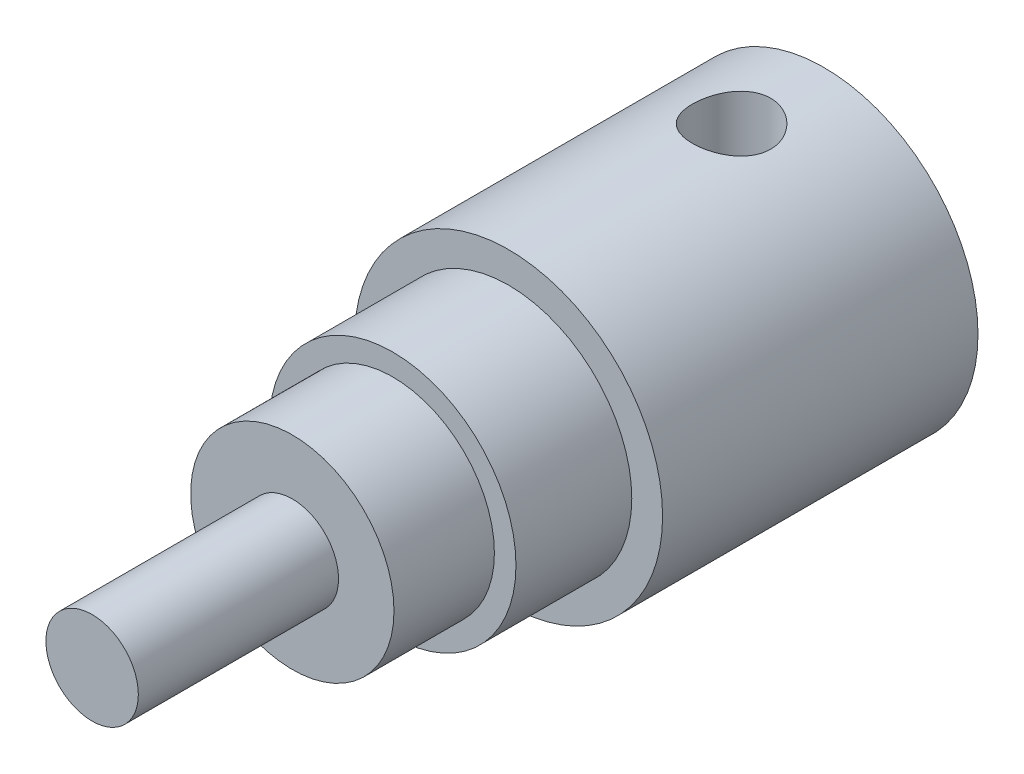
ISO-10303-21;
HEADER;
FILE_DESCRIPTION(('STEP AP214'),'2;1');
FILE_NAME('part.step','',(''),(''),'','','');
FILE_SCHEMA(('AUTOMOTIVE_DESIGN { 1 0 10303 214 1 1 1 1 }'));
ENDSEC;
DATA;
#1=APPLICATION_CONTEXT('core data for automotive mechanical design processes');
#2=APPLICATION_PROTOCOL_DEFINITION('international standard','automotive_design',2000,#1);
#3=PRODUCT_CONTEXT('',#1,'mechanical');
#4=PRODUCT('Part','Part','',(#3));
#5=PRODUCT_RELATED_PRODUCT_CATEGORY('part','',(#4));
#6=PRODUCT_DEFINITION_FORMATION('','',#4);
#7=PRODUCT_DEFINITION_CONTEXT('part definition',#1,'design');
#8=PRODUCT_DEFINITION('design','',#6,#7);
#9=PRODUCT_DEFINITION_SHAPE('','',#8);
#10=(LENGTH_UNIT() NAMED_UNIT(*) SI_UNIT(.MILLI.,.METRE.));
#11=(NAMED_UNIT(*) PLANE_ANGLE_UNIT() SI_UNIT($,.RADIAN.));
#12=(NAMED_UNIT(*) SI_UNIT($,.STERADIAN.) SOLID_ANGLE_UNIT());
#13=UNCERTAINTY_MEASURE_WITH_UNIT(LENGTH_MEASURE(1.E-05),#10,'distance_accuracy_value','');
#14=(GEOMETRIC_REPRESENTATION_CONTEXT(3) GLOBAL_UNCERTAINTY_ASSIGNED_CONTEXT((#13)) GLOBAL_UNIT_ASSIGNED_CONTEXT((#10,
#11,#12)) REPRESENTATION_CONTEXT('',''));
#15=CARTESIAN_POINT('',(0.,0.,0.));
#16=DIRECTION('',(0.,0.,1.));
#17=DIRECTION('',(1.,0.,0.));
#18=AXIS2_PLACEMENT_3D('',#15,#16,#17);
#19=CARTESIAN_POINT('',(0.,0.,86.7));
#20=DIRECTION('',(0.,0.,-1.));
#21=DIRECTION('',(-1.,0.,0.));
#22=AXIS2_PLACEMENT_3D('',#19,#20,#21);
#23=CYLINDRICAL_SURFACE('',#22,16.5);
#24=CARTESIAN_POINT('',(0.,0.,70.));
#25=DIRECTION('',(0.,0.,1.));
#26=DIRECTION('',(1.,0.,0.));
#27=AXIS2_PLACEMENT_3D('',#24,#25,#26);
#28=CIRCLE('',#27,16.5);
#29=CARTESIAN_POINT('',(16.5,0.,70.));
#30=VERTEX_POINT('',#29);
#31=EDGE_CURVE('E11',#30,#30,#28,.T.);
#32=ORIENTED_EDGE('',*,*,#31,.T.);
#33=EDGE_LOOP('',(#32));
#34=FACE_BOUND('',#33,.T.);
#35=CARTESIAN_POINT('',(0.,0.,86.3));
#36=DIRECTION('',(0.,0.,1.));
#37=DIRECTION('',(1.,0.,0.));
#38=AXIS2_PLACEMENT_3D('',#35,#36,#37);
#39=CIRCLE('',#38,16.5);
#40=CARTESIAN_POINT('',(16.5,0.,86.3));
#41=VERTEX_POINT('',#40);
#42=EDGE_CURVE('E46',#41,#41,#39,.T.);
#43=ORIENTED_EDGE('',*,*,#42,.F.);
#44=EDGE_LOOP('',(#43));
#45=FACE_BOUND('',#44,.T.);
#46=ADVANCED_FACE('F41',(#34,#45),#23,.T.);
#47=CARTESIAN_POINT('',(0.,0.,51.2));
#48=DIRECTION('',(0.,0.,-1.));
#49=DIRECTION('',(-1.,0.,0.));
#50=AXIS2_PLACEMENT_3D('',#47,#48,#49);
#51=CYLINDRICAL_SURFACE('',#50,25.);
#52=CARTESIAN_POINT('',(0.,-25.,21.35));
#53=CARTESIAN_POINT('',(0.175385131929487,-25.0000033140325,21.3500054099431));
#54=CARTESIAN_POINT('',(0.350711748212745,-24.998151704908,21.3427328728794));
#55=CARTESIAN_POINT('',(0.700135931108324,-24.9908042668233,21.3137168326743));
#56=CARTESIAN_POINT('',(0.874233361490483,-24.9853080401456,21.2919717502209));
#57=CARTESIAN_POINT('',(1.21993244028655,-24.9708174064133,21.2341796780531));
#58=CARTESIAN_POINT('',(1.39153334466094,-24.9618219777842,21.1981285116872));
#59=CARTESIAN_POINT('',(1.73104281582321,-24.9405779457084,21.1120103227938));
#60=CARTESIAN_POINT('',(1.89894999679082,-24.92832814308,21.0619381333887));
#61=CARTESIAN_POINT('',(2.22957313318312,-24.9009333086136,20.9482782193175));
#62=CARTESIAN_POINT('',(2.39229703984096,-24.8857929878945,20.884712468562));
#63=CARTESIAN_POINT('',(2.71180585607342,-24.8530060892262,20.7444806948715));
#64=CARTESIAN_POINT('',(2.86858854648412,-24.8353585862576,20.6678098347052));
#65=CARTESIAN_POINT('',(3.17507415772351,-24.7980388505881,20.5019771427345));
#66=CARTESIAN_POINT('',(3.32477957941938,-24.7783673410266,20.4128197680435));
#67=CARTESIAN_POINT('',(3.61627276678461,-24.7375068038783,20.2225830138152));
#68=CARTESIAN_POINT('',(3.75805752505357,-24.7163172067649,20.1214991506316));
#69=CARTESIAN_POINT('',(4.03532969402347,-24.6725795464707,19.9061190207149));
#70=CARTESIAN_POINT('',(4.17064997364941,-24.6500135000218,19.7916112009001));
#71=CARTESIAN_POINT('',(4.43126322722715,-24.604499890037,19.5516799371048));
#72=CARTESIAN_POINT('',(4.5565524618244,-24.5815521880429,19.4262524585486));
#73=CARTESIAN_POINT('',(4.79620123658546,-24.5359192277785,19.1653712680362));
#74=CARTESIAN_POINT('',(4.91056349701768,-24.5132339054314,19.0299200664626));
#75=CARTESIAN_POINT('',(5.12766970707211,-24.4687410868686,18.7497890634005));
#76=CARTESIAN_POINT('',(5.23040935139997,-24.4469339178558,18.6051058730001));
#77=CARTESIAN_POINT('',(5.42496619160096,-24.4045038749107,18.3052471607241));
#78=CARTESIAN_POINT('',(5.51659553987815,-24.3839037894737,18.1499464154619));
#79=CARTESIAN_POINT('',(5.68644683418524,-24.3448540601681,17.8318460897849));
#80=CARTESIAN_POINT('',(5.76466370521984,-24.3264052311302,17.6690437003389));
#81=CARTESIAN_POINT('',(5.9069972915349,-24.292236559421,17.3371853808661));
#82=CARTESIAN_POINT('',(5.97112106435674,-24.2765153516461,17.168132630674));
#83=CARTESIAN_POINT('',(6.08480496079491,-24.2482684978705,16.8249423418518));
#84=CARTESIAN_POINT('',(6.13435987562112,-24.2357439949951,16.6508030090238));
#85=CARTESIAN_POINT('',(6.25867119421337,-24.2040633255174,16.1299145562071));
#86=CARTESIAN_POINT('',(6.31219365671174,-24.1900229808473,15.7773869553189));
#87=CARTESIAN_POINT('',(6.34773296739198,-24.1806996532994,15.2460068033738));
#88=CARTESIAN_POINT('',(6.35211509987145,-24.1795498874752,15.0683800615206));
#89=CARTESIAN_POINT('',(6.34600958727861,-24.1811534720988,14.7133782625875));
#90=CARTESIAN_POINT('',(6.33552180276144,-24.1839068591489,14.5360032078833));
#91=CARTESIAN_POINT('',(6.28268809717186,-24.1977155031317,14.0152322936276));
#92=CARTESIAN_POINT('',(6.21956614571278,-24.2141664349554,13.6738553985158));
#93=CARTESIAN_POINT('',(6.03900283866144,-24.2598212948346,13.0068846713011));
#94=CARTESIAN_POINT('',(5.92155750230573,-24.2890261574767,12.6812919977823));
#95=CARTESIAN_POINT('',(5.6344406783203,-24.3572368702812,12.0509838529052));
#96=CARTESIAN_POINT('',(5.46423991264386,-24.3963412756549,11.7465200703768));
#97=CARTESIAN_POINT('',(5.07681252447857,-24.479892350873,11.1699628976026));
#98=CARTESIAN_POINT('',(4.8595774296198,-24.5243399825589,10.8978753530418));
#99=CARTESIAN_POINT('',(4.37666050491634,-24.6151752029657,10.385358502392));
#100=CARTESIAN_POINT('',(4.10973956733923,-24.661581359405,10.1460985302972));
#101=CARTESIAN_POINT('',(3.53898905594361,-24.7499248963044,9.71551153610942));
#102=CARTESIAN_POINT('',(3.23515828244191,-24.7918621314276,9.52418607265477));
#103=CARTESIAN_POINT('',(2.59758157702115,-24.8667639765151,9.19445107466391));
#104=CARTESIAN_POINT('',(2.2637308381859,-24.8996953901051,9.05623657417293));
#105=CARTESIAN_POINT('',(1.57629931595442,-24.9526282129545,8.83822054163615));
#106=CARTESIAN_POINT('',(1.22272244694252,-24.9726321776478,8.75840746467474));
#107=CARTESIAN_POINT('',(0.690770502675092,-24.9910699052583,8.68522034531726));
#108=CARTESIAN_POINT('',(0.515500629471045,-24.9953043832338,8.66850903652274));
#109=CARTESIAN_POINT('',(0.164143779856978,-25.0000762389562,8.64968969067066));
#110=CARTESIAN_POINT('',(-0.0119428655650596,-25.0006150022359,8.64757618085986));
#111=CARTESIAN_POINT('',(-0.363660306591557,-24.9979742005041,8.65797927589998));
#112=CARTESIAN_POINT('',(-0.539291052760423,-24.9947942478547,8.67049740594938));
#113=CARTESIAN_POINT('',(-0.888803892814272,-24.9848070393398,8.71005154312242));
#114=CARTESIAN_POINT('',(-1.06268603283897,-24.9779998794412,8.73708716614984));
#115=CARTESIAN_POINT('',(-1.40478706505814,-24.9610788400627,8.80492006918042));
#116=CARTESIAN_POINT('',(-1.57305193240279,-24.9510174872923,8.8454990542083));
#117=CARTESIAN_POINT('',(-1.90551391214506,-24.9278315337674,8.94018231292668));
#118=CARTESIAN_POINT('',(-2.06971103024151,-24.9147069373046,8.99428656766741));
#119=CARTESIAN_POINT('',(-2.39297866197959,-24.885738851179,9.11561668278025));
#120=CARTESIAN_POINT('',(-2.5520479204993,-24.8698947017767,9.18284572765596));
#121=CARTESIAN_POINT('',(-2.8639328165778,-24.8359113238401,9.32989382182563));
#122=CARTESIAN_POINT('',(-3.01675049492381,-24.8177728523133,9.40970872057288));
#123=CARTESIAN_POINT('',(-3.31799190742229,-24.7793142249094,9.58297331058306));
#124=CARTESIAN_POINT('',(-3.46628169429449,-24.7589598620779,9.67664830854903));
#125=CARTESIAN_POINT('',(-3.75443091494178,-24.716906066827,9.87580128872815));
#126=CARTESIAN_POINT('',(-3.89429316174534,-24.6952070881876,9.98127529859231));
#127=CARTESIAN_POINT('',(-4.16482780953606,-24.6510244720375,10.2034015188438));
#128=CARTESIAN_POINT('',(-4.29549549202925,-24.6285404403791,10.3200593970977));
#129=CARTESIAN_POINT('',(-4.54669182494445,-24.5834065181769,10.5637065419216));
#130=CARTESIAN_POINT('',(-4.66722397854383,-24.5607566879054,10.6906922087624));
#131=CARTESIAN_POINT('',(-4.90040324536703,-24.5153120079901,10.9576295394875));
#132=CARTESIAN_POINT('',(-5.01276648501162,-24.4925285086167,11.0978312941315));
#133=CARTESIAN_POINT('',(-5.22524789579797,-24.4480789818796,11.3873126498664));
#134=CARTESIAN_POINT('',(-5.32537052190115,-24.4264125496304,11.5365889185018));
#135=CARTESIAN_POINT('',(-5.51273292509099,-24.3848106858986,11.8433269675273));
#136=CARTESIAN_POINT('',(-5.5999679983822,-24.3648758875291,12.0007917083962));
#137=CARTESIAN_POINT('',(-5.76081936737025,-24.3273463910993,12.3227207829183));
#138=CARTESIAN_POINT('',(-5.83444114157494,-24.309750752477,12.4871822678957));
#139=CARTESIAN_POINT('',(-5.96715018090579,-24.2775155048581,12.8210757013109));
#140=CARTESIAN_POINT('',(-6.02631656454941,-24.2628598870434,12.9904746407226));
#141=CARTESIAN_POINT('',(-6.13013627779891,-24.2368375789666,13.3338411647936));
#142=CARTESIAN_POINT('',(-6.17479521125169,-24.2254696189552,13.5078069572651));
#143=CARTESIAN_POINT('',(-6.24924480760445,-24.2063714529045,13.8590903842994));
#144=CARTESIAN_POINT('',(-6.27903543982851,-24.1986412543705,14.0364080257769));
#145=CARTESIAN_POINT('',(-6.32348068118509,-24.1870651827754,14.3930546713557));
#146=CARTESIAN_POINT('',(-6.3381356689265,-24.1832192125527,14.5723836250317));
#147=CARTESIAN_POINT('',(-6.35196741532382,-24.17958967931,14.9263056479132));
#148=CARTESIAN_POINT('',(-6.35159362065699,-24.1796881544406,15.1008801009263));
#149=CARTESIAN_POINT('',(-6.33647814832019,-24.1836536944327,15.4494241678649));
#150=CARTESIAN_POINT('',(-6.32173151884021,-24.1875220581174,15.6233935525979));
#151=CARTESIAN_POINT('',(-6.27799859048092,-24.1989099365428,15.9693403160074));
#152=CARTESIAN_POINT('',(-6.24901790761044,-24.2064280112858,16.1413184529562));
#153=CARTESIAN_POINT('',(-6.17705027748429,-24.2248927374141,16.4821962628097));
#154=CARTESIAN_POINT('',(-6.13405811669454,-24.2358406649553,16.6510947650726));
#155=CARTESIAN_POINT('',(-6.03475741455481,-24.2607564191176,16.9834519637395));
#156=CARTESIAN_POINT('',(-5.9785405559036,-24.2747033994636,17.1469396466053));
#157=CARTESIAN_POINT('',(-5.85304980514577,-24.3052664392567,17.4686285234356));
#158=CARTESIAN_POINT('',(-5.78377145539905,-24.3218834096341,17.6268278908337));
#159=CARTESIAN_POINT('',(-5.63268434139098,-24.3573168421669,17.9368522797336));
#160=CARTESIAN_POINT('',(-5.55087642656447,-24.3761331551987,18.0886777324632));
#161=CARTESIAN_POINT('',(-5.37529693336304,-24.415451526107,18.3850179438036));
#162=CARTESIAN_POINT('',(-5.28152501592703,-24.4359536317531,18.5295324950606));
#163=CARTESIAN_POINT('',(-5.0799505600607,-24.4786641348243,18.8141617731391));
#164=CARTESIAN_POINT('',(-4.97183707362827,-24.5009036881897,18.9540516982394));
#165=CARTESIAN_POINT('',(-4.74441701318979,-24.5459556050014,19.2242370300207));
#166=CARTESIAN_POINT('',(-4.62511399688802,-24.5687677847036,19.3545354629514));
#167=CARTESIAN_POINT('',(-4.37599360895126,-24.6143600323575,19.6048206454826));
#168=CARTESIAN_POINT('',(-4.24617018504563,-24.6371400740438,19.7248013764459));
#169=CARTESIAN_POINT('',(-3.97695652834308,-24.6820264544071,19.9535345889522));
#170=CARTESIAN_POINT('',(-3.83756977795974,-24.7041330341302,20.0622911219546));
#171=CARTESIAN_POINT('',(-3.547306953288,-24.7474958900468,20.269872599814));
#172=CARTESIAN_POINT('',(-3.39626113955255,-24.7687275444089,20.3684655492735));
#173=CARTESIAN_POINT('',(-3.08619692050165,-24.8092689611298,20.5525113988661));
#174=CARTESIAN_POINT('',(-2.92718147342273,-24.8285794287816,20.6379691274376));
#175=CARTESIAN_POINT('',(-2.60227981802529,-24.864730563437,20.7950994826663));
#176=CARTESIAN_POINT('',(-2.43639649502683,-24.8815722543835,20.8667778282846));
#177=CARTESIAN_POINT('',(-2.09893912814839,-24.9123102089582,20.9957990746599));
#178=CARTESIAN_POINT('',(-1.92736592500747,-24.9262069055172,21.0531440827209));
#179=CARTESIAN_POINT('',(-1.46941499709399,-24.9583988941249,21.1847047232181));
#180=CARTESIAN_POINT('',(-1.1791896569923,-24.9739004364578,21.2465805264305));
#181=CARTESIAN_POINT('',(-0.592586910015832,-24.994697780879,21.3292219449746));
#182=CARTESIAN_POINT('',(-0.296209999329344,-24.9999944028919,21.3499908630839));
#183=CARTESIAN_POINT('',(0.,-25.,21.35));
#184=B_SPLINE_CURVE_WITH_KNOTS('',3,(#52,#53,#54,#55,#56,#57,#58,#59,#60,#61,#62,#63,#64,#65,
#66,#67,#68,#69,#70,#71,#72,#73,#74,#75,#76,#77,#78,#79,#80,#81,#82,#83,#84,#85,#86,#87,#88,#89,
#90,#91,#92,#93,#94,#95,#96,#97,#98,#99,#100,#101,#102,#103,#104,#105,#106,#107,#108,#109,#110,
#111,#112,#113,#114,#115,#116,#117,#118,#119,#120,#121,#122,#123,#124,#125,#126,#127,#128,#129,
#130,#131,#132,#133,#134,#135,#136,#137,#138,#139,#140,#141,#142,#143,#144,#145,#146,#147,#148,
#149,#150,#151,#152,#153,#154,#155,#156,#157,#158,#159,#160,#161,#162,#163,#164,#165,#166,#167,
#168,#169,#170,#171,#172,#173,#174,#175,#176,#177,#178,#179,#180,#181,#182,#183),.UNSPECIFIED.,
.T.,.F.,(4,2,2,2,2,2,2,2,2,2,2,2,2,2,2,2,2,2,2,2,2,2,2,2,2,2,2,2,2,2,2,2,2,2,2,2,2,2,2,2,2,2,2,
2,2,2,2,2,2,2,2,2,2,2,2,2,2,2,2,2,2,2,2,2,2,4),(0.,0.525894291514284,1.05184598048871,
1.57795133380533,2.10425081756704,2.62969972268931,3.15534299691436,3.68079911654444,
4.2064534094648,4.74192791781956,5.27760111886222,5.81314061477869,6.34887784219313,
6.89268532850275,7.43669812809239,7.98043787305707,8.52437178502414,9.58859222247416,
10.1211107365749,10.65363424448,11.6909869614513,12.7284157066406,13.7766093089753,
14.8249918814409,15.9042716702649,16.9835865483923,18.0668278487388,19.1498549537846,
19.6776748235799,20.2052968015711,20.732973783651,21.2606368054174,21.7801754910284,
22.2997134487365,22.819377620376,23.3388707748597,23.8679930235595,24.3969376668552,
24.9261518052155,25.455182271151,25.9978695430778,26.5403587126887,27.0830453974549,
27.6255132069195,28.1649418495406,28.7041618765946,29.2433830161497,29.782590667091,
30.3056852655637,30.8289601472616,31.3520287378588,31.8752921798032,32.3950296823312,
32.9149448835854,33.4348248530694,33.9547195592809,34.4886793240125,35.0224698883945,
35.556569746653,36.0904761382411,36.6346795550175,37.178682444569,37.7224590627247,
38.2661556871176,39.1544160741938,40.0426050901212),.UNSPECIFIED.);
#185=CARTESIAN_POINT('',(0.,-25.,21.35));
#186=VERTEX_POINT('',#185);
#187=EDGE_CURVE('E64',#186,#186,#184,.T.);
#188=ORIENTED_EDGE('',*,*,#187,.T.);
#189=EDGE_LOOP('',(#188));
#190=FACE_BOUND('',#189,.T.);
#191=CARTESIAN_POINT('',(0.,25.,21.35));
#192=CARTESIAN_POINT('',(-0.175385131929487,25.0000033140325,21.3500054099431));
#193=CARTESIAN_POINT('',(-0.350711748212745,24.998151704908,21.3427328728794));
#194=CARTESIAN_POINT('',(-0.700135931108324,24.9908042668233,21.3137168326743));
#195=CARTESIAN_POINT('',(-0.874233361490483,24.9853080401456,21.2919717502209));
#196=CARTESIAN_POINT('',(-1.21993244028655,24.9708174064133,21.2341796780531));
#197=CARTESIAN_POINT('',(-1.39153334466094,24.9618219777842,21.1981285116872));
#198=CARTESIAN_POINT('',(-1.73104281582321,24.9405779457084,21.1120103227938));
#199=CARTESIAN_POINT('',(-1.89894999679082,24.92832814308,21.0619381333887));
#200=CARTESIAN_POINT('',(-2.22957313318312,24.9009333086136,20.9482782193175));
#201=CARTESIAN_POINT('',(-2.39229703984096,24.8857929878945,20.884712468562));
#202=CARTESIAN_POINT('',(-2.71180585607342,24.8530060892262,20.7444806948715));
#203=CARTESIAN_POINT('',(-2.86858854648412,24.8353585862576,20.6678098347052));
#204=CARTESIAN_POINT('',(-3.17507415772351,24.7980388505881,20.5019771427345));
#205=CARTESIAN_POINT('',(-3.32477957941938,24.7783673410266,20.4128197680435));
#206=CARTESIAN_POINT('',(-3.61627276678461,24.7375068038783,20.2225830138152));
#207=CARTESIAN_POINT('',(-3.75805752505357,24.7163172067649,20.1214991506316));
#208=CARTESIAN_POINT('',(-4.03532969402347,24.6725795464707,19.9061190207149));
#209=CARTESIAN_POINT('',(-4.17064997364941,24.6500135000218,19.7916112009001));
#210=CARTESIAN_POINT('',(-4.43126322722715,24.604499890037,19.5516799371048));
#211=CARTESIAN_POINT('',(-4.5565524618244,24.5815521880429,19.4262524585486));
#212=CARTESIAN_POINT('',(-4.79620123658546,24.5359192277785,19.1653712680362));
#213=CARTESIAN_POINT('',(-4.91056349701768,24.5132339054314,19.0299200664626));
#214=CARTESIAN_POINT('',(-5.12766970707211,24.4687410868686,18.7497890634005));
#215=CARTESIAN_POINT('',(-5.23040935139997,24.4469339178558,18.6051058730001));
#216=CARTESIAN_POINT('',(-5.42496619160096,24.4045038749107,18.3052471607241));
#217=CARTESIAN_POINT('',(-5.51659553987815,24.3839037894737,18.1499464154619));
#218=CARTESIAN_POINT('',(-5.68644683418524,24.3448540601681,17.8318460897849));
#219=CARTESIAN_POINT('',(-5.76466370521984,24.3264052311302,17.6690437003389));
#220=CARTESIAN_POINT('',(-5.9069972915349,24.292236559421,17.3371853808661));
#221=CARTESIAN_POINT('',(-5.97112106435674,24.2765153516461,17.168132630674));
#222=CARTESIAN_POINT('',(-6.08480496079491,24.2482684978705,16.8249423418518));
#223=CARTESIAN_POINT('',(-6.13435987562112,24.2357439949951,16.6508030090238));
#224=CARTESIAN_POINT('',(-6.25867119421337,24.2040633255174,16.1299145562071));
#225=CARTESIAN_POINT('',(-6.31219365671174,24.1900229808473,15.7773869553189));
#226=CARTESIAN_POINT('',(-6.34773296739198,24.1806996532994,15.2460068033738));
#227=CARTESIAN_POINT('',(-6.35211509987145,24.1795498874752,15.0683800615206));
#228=CARTESIAN_POINT('',(-6.34600958727861,24.1811534720988,14.7133782625875));
#229=CARTESIAN_POINT('',(-6.33552180276144,24.1839068591489,14.5360032078833));
#230=CARTESIAN_POINT('',(-6.28268809717186,24.1977155031317,14.0152322936276));
#231=CARTESIAN_POINT('',(-6.21956614571278,24.2141664349554,13.6738553985158));
#232=CARTESIAN_POINT('',(-6.03900283866144,24.2598212948346,13.0068846713011));
#233=CARTESIAN_POINT('',(-5.92155750230573,24.2890261574767,12.6812919977823));
#234=CARTESIAN_POINT('',(-5.6344406783203,24.3572368702812,12.0509838529052));
#235=CARTESIAN_POINT('',(-5.46423991264386,24.3963412756549,11.7465200703768));
#236=CARTESIAN_POINT('',(-5.07681252447857,24.479892350873,11.1699628976026));
#237=CARTESIAN_POINT('',(-4.8595774296198,24.5243399825589,10.8978753530418));
#238=CARTESIAN_POINT('',(-4.37666050491634,24.6151752029657,10.385358502392));
#239=CARTESIAN_POINT('',(-4.10973956733923,24.661581359405,10.1460985302972));
#240=CARTESIAN_POINT('',(-3.53898905594361,24.7499248963044,9.71551153610942));
#241=CARTESIAN_POINT('',(-3.23515828244191,24.7918621314276,9.52418607265477));
#242=CARTESIAN_POINT('',(-2.59758157702115,24.8667639765151,9.19445107466391));
#243=CARTESIAN_POINT('',(-2.2637308381859,24.8996953901051,9.05623657417293));
#244=CARTESIAN_POINT('',(-1.57629931595442,24.9526282129545,8.83822054163615));
#245=CARTESIAN_POINT('',(-1.22272244694252,24.9726321776478,8.75840746467474));
#246=CARTESIAN_POINT('',(-0.690770502675092,24.9910699052583,8.68522034531726));
#247=CARTESIAN_POINT('',(-0.515500629471045,24.9953043832338,8.66850903652274));
#248=CARTESIAN_POINT('',(-0.164143779856978,25.0000762389562,8.64968969067066));
#249=CARTESIAN_POINT('',(0.0119428655650596,25.0006150022359,8.64757618085986));
#250=CARTESIAN_POINT('',(0.363660306591557,24.9979742005041,8.65797927589998));
#251=CARTESIAN_POINT('',(0.539291052760423,24.9947942478547,8.67049740594938));
#252=CARTESIAN_POINT('',(0.888803892814272,24.9848070393398,8.71005154312242));
#253=CARTESIAN_POINT('',(1.06268603283897,24.9779998794412,8.73708716614984));
#254=CARTESIAN_POINT('',(1.40478706505814,24.9610788400627,8.80492006918042));
#255=CARTESIAN_POINT('',(1.57305193240279,24.9510174872923,8.8454990542083));
#256=CARTESIAN_POINT('',(1.90551391214506,24.9278315337674,8.94018231292668));
#257=CARTESIAN_POINT('',(2.06971103024151,24.9147069373046,8.99428656766741));
#258=CARTESIAN_POINT('',(2.39297866197959,24.885738851179,9.11561668278025));
#259=CARTESIAN_POINT('',(2.5520479204993,24.8698947017767,9.18284572765596));
#260=CARTESIAN_POINT('',(2.8639328165778,24.8359113238401,9.32989382182563));
#261=CARTESIAN_POINT('',(3.01675049492381,24.8177728523133,9.40970872057288));
#262=CARTESIAN_POINT('',(3.31799190742229,24.7793142249094,9.58297331058306));
#263=CARTESIAN_POINT('',(3.46628169429449,24.7589598620779,9.67664830854903));
#264=CARTESIAN_POINT('',(3.75443091494178,24.716906066827,9.87580128872815));
#265=CARTESIAN_POINT('',(3.89429316174534,24.6952070881876,9.98127529859231));
#266=CARTESIAN_POINT('',(4.16482780953606,24.6510244720375,10.2034015188438));
#267=CARTESIAN_POINT('',(4.29549549202925,24.6285404403791,10.3200593970977));
#268=CARTESIAN_POINT('',(4.54669182494445,24.5834065181769,10.5637065419216));
#269=CARTESIAN_POINT('',(4.66722397854383,24.5607566879054,10.6906922087624));
#270=CARTESIAN_POINT('',(4.90040324536703,24.5153120079901,10.9576295394875));
#271=CARTESIAN_POINT('',(5.01276648501162,24.4925285086167,11.0978312941315));
#272=CARTESIAN_POINT('',(5.22524789579797,24.4480789818796,11.3873126498664));
#273=CARTESIAN_POINT('',(5.32537052190115,24.4264125496304,11.5365889185018));
#274=CARTESIAN_POINT('',(5.51273292509099,24.3848106858986,11.8433269675273));
#275=CARTESIAN_POINT('',(5.5999679983822,24.3648758875291,12.0007917083962));
#276=CARTESIAN_POINT('',(5.76081936737025,24.3273463910993,12.3227207829183));
#277=CARTESIAN_POINT('',(5.83444114157494,24.309750752477,12.4871822678957));
#278=CARTESIAN_POINT('',(5.96715018090579,24.2775155048581,12.8210757013109));
#279=CARTESIAN_POINT('',(6.02631656454941,24.2628598870434,12.9904746407226));
#280=CARTESIAN_POINT('',(6.13013627779891,24.2368375789666,13.3338411647936));
#281=CARTESIAN_POINT('',(6.17479521125169,24.2254696189552,13.5078069572651));
#282=CARTESIAN_POINT('',(6.24924480760445,24.2063714529045,13.8590903842994));
#283=CARTESIAN_POINT('',(6.27903543982851,24.1986412543705,14.0364080257769));
#284=CARTESIAN_POINT('',(6.32348068118509,24.1870651827754,14.3930546713557));
#285=CARTESIAN_POINT('',(6.3381356689265,24.1832192125527,14.5723836250317));
#286=CARTESIAN_POINT('',(6.35196741532382,24.17958967931,14.9263056479132));
#287=CARTESIAN_POINT('',(6.35159362065699,24.1796881544406,15.1008801009263));
#288=CARTESIAN_POINT('',(6.33647814832019,24.1836536944327,15.4494241678649));
#289=CARTESIAN_POINT('',(6.32173151884021,24.1875220581174,15.6233935525979));
#290=CARTESIAN_POINT('',(6.27799859048092,24.1989099365428,15.9693403160074));
#291=CARTESIAN_POINT('',(6.24901790761044,24.2064280112858,16.1413184529562));
#292=CARTESIAN_POINT('',(6.17705027748429,24.2248927374141,16.4821962628097));
#293=CARTESIAN_POINT('',(6.13405811669454,24.2358406649553,16.6510947650726));
#294=CARTESIAN_POINT('',(6.03475741455481,24.2607564191176,16.9834519637395));
#295=CARTESIAN_POINT('',(5.9785405559036,24.2747033994636,17.1469396466053));
#296=CARTESIAN_POINT('',(5.85304980514577,24.3052664392567,17.4686285234356));
#297=CARTESIAN_POINT('',(5.78377145539905,24.3218834096341,17.6268278908337));
#298=CARTESIAN_POINT('',(5.63268434139098,24.3573168421669,17.9368522797336));
#299=CARTESIAN_POINT('',(5.55087642656447,24.3761331551987,18.0886777324632));
#300=CARTESIAN_POINT('',(5.37529693336304,24.415451526107,18.3850179438036));
#301=CARTESIAN_POINT('',(5.28152501592703,24.4359536317531,18.5295324950606));
#302=CARTESIAN_POINT('',(5.0799505600607,24.4786641348243,18.8141617731391));
#303=CARTESIAN_POINT('',(4.97183707362827,24.5009036881897,18.9540516982394));
#304=CARTESIAN_POINT('',(4.74441701318979,24.5459556050014,19.2242370300207));
#305=CARTESIAN_POINT('',(4.62511399688802,24.5687677847036,19.3545354629514));
#306=CARTESIAN_POINT('',(4.37599360895126,24.6143600323575,19.6048206454826));
#307=CARTESIAN_POINT('',(4.24617018504563,24.6371400740438,19.7248013764459));
#308=CARTESIAN_POINT('',(3.97695652834308,24.6820264544071,19.9535345889522));
#309=CARTESIAN_POINT('',(3.83756977795974,24.7041330341302,20.0622911219546));
#310=CARTESIAN_POINT('',(3.547306953288,24.7474958900468,20.269872599814));
#311=CARTESIAN_POINT('',(3.39626113955255,24.7687275444089,20.3684655492735));
#312=CARTESIAN_POINT('',(3.08619692050165,24.8092689611298,20.5525113988661));
#313=CARTESIAN_POINT('',(2.92718147342273,24.8285794287816,20.6379691274376));
#314=CARTESIAN_POINT('',(2.60227981802529,24.864730563437,20.7950994826663));
#315=CARTESIAN_POINT('',(2.43639649502683,24.8815722543835,20.8667778282846));
#316=CARTESIAN_POINT('',(2.09893912814839,24.9123102089582,20.9957990746599));
#317=CARTESIAN_POINT('',(1.92736592500747,24.9262069055172,21.0531440827209));
#318=CARTESIAN_POINT('',(1.46941499709399,24.9583988941249,21.1847047232181));
#319=CARTESIAN_POINT('',(1.1791896569923,24.9739004364578,21.2465805264305));
#320=CARTESIAN_POINT('',(0.592586910015832,24.994697780879,21.3292219449746));
#321=CARTESIAN_POINT('',(0.296209999329344,24.9999944028919,21.3499908630839));
#322=CARTESIAN_POINT('',(0.,25.,21.35));
#323=B_SPLINE_CURVE_WITH_KNOTS('',3,(#191,#192,#193,#194,#195,#196,#197,#198,#199,#200,#201,
#202,#203,#204,#205,#206,#207,#208,#209,#210,#211,#212,#213,#214,#215,#216,#217,#218,#219,#220,
#221,#222,#223,#224,#225,#226,#227,#228,#229,#230,#231,#232,#233,#234,#235,#236,#237,#238,#239,
#240,#241,#242,#243,#244,#245,#246,#247,#248,#249,#250,#251,#252,#253,#254,#255,#256,#257,#258,
#259,#260,#261,#262,#263,#264,#265,#266,#267,#268,#269,#270,#271,#272,#273,#274,#275,#276,#277,
#278,#279,#280,#281,#282,#283,#284,#285,#286,#287,#288,#289,#290,#291,#292,#293,#294,#295,#296,
#297,#298,#299,#300,#301,#302,#303,#304,#305,#306,#307,#308,#309,#310,#311,#312,#313,#314,#315,
#316,#317,#318,#319,#320,#321,#322),.UNSPECIFIED.,.T.,.F.,(4,2,2,2,2,2,2,2,2,2,2,2,2,2,2,2,2,2,
2,2,2,2,2,2,2,2,2,2,2,2,2,2,2,2,2,2,2,2,2,2,2,2,2,2,2,2,2,2,2,2,2,2,2,2,2,2,2,2,2,2,2,2,2,2,2,
4),(0.,0.525894291514284,1.05184598048871,1.57795133380533,2.10425081756704,2.62969972268931,
3.15534299691436,3.68079911654444,4.2064534094648,4.74192791781956,5.27760111886222,
5.81314061477869,6.34887784219313,6.89268532850275,7.43669812809239,7.98043787305707,
8.52437178502414,9.58859222247416,10.1211107365749,10.65363424448,11.6909869614513,
12.7284157066406,13.7766093089753,14.8249918814409,15.9042716702649,16.9835865483923,
18.0668278487388,19.1498549537846,19.6776748235799,20.2052968015711,20.732973783651,
21.2606368054174,21.7801754910284,22.2997134487365,22.819377620376,23.3388707748597,
23.8679930235595,24.3969376668552,24.9261518052155,25.455182271151,25.9978695430778,
26.5403587126887,27.0830453974549,27.6255132069195,28.1649418495406,28.7041618765946,
29.2433830161497,29.782590667091,30.3056852655637,30.8289601472616,31.3520287378588,
31.8752921798032,32.3950296823312,32.9149448835854,33.4348248530694,33.9547195592809,
34.4886793240125,35.0224698883945,35.556569746653,36.0904761382411,36.6346795550175,
37.178682444569,37.7224590627247,38.2661556871176,39.1544160741938,40.0426050901212),.UNSPECIFIED.);
#324=CARTESIAN_POINT('',(0.,25.,21.35));
#325=VERTEX_POINT('',#324);
#326=EDGE_CURVE('E70',#325,#325,#323,.T.);
#327=ORIENTED_EDGE('',*,*,#326,.T.);
#328=EDGE_LOOP('',(#327));
#329=FACE_BOUND('',#328,.T.);
#330=CARTESIAN_POINT('',(0.,0.,51.2));
#331=DIRECTION('',(0.,0.,1.));
#332=DIRECTION('',(1.,0.,0.));
#333=AXIS2_PLACEMENT_3D('',#330,#331,#332);
#334=CIRCLE('',#333,25.);
#335=CARTESIAN_POINT('',(25.,0.,51.2));
#336=VERTEX_POINT('',#335);
#337=EDGE_CURVE('E55',#336,#336,#334,.T.);
#338=ORIENTED_EDGE('',*,*,#337,.F.);
#339=EDGE_LOOP('',(#338));
#340=FACE_BOUND('',#339,.T.);
#341=CARTESIAN_POINT('',(0.,0.,0.));
#342=DIRECTION('',(0.,0.,1.));
#343=DIRECTION('',(1.,0.,0.));
#344=AXIS2_PLACEMENT_3D('',#341,#342,#343);
#345=CIRCLE('',#344,25.);
#346=CARTESIAN_POINT('',(25.,0.,0.));
#347=VERTEX_POINT('',#346);
#348=EDGE_CURVE('E63',#347,#347,#345,.T.);
#349=ORIENTED_EDGE('',*,*,#348,.T.);
#350=EDGE_LOOP('',(#349));
#351=FACE_BOUND('',#350,.T.);
#352=ADVANCED_FACE('F43',(#190,#329,#340,#351),#51,.T.);
#353=CARTESIAN_POINT('',(0.,0.,51.2));
#354=DIRECTION('',(0.,0.,1.));
#355=DIRECTION('',(1.,0.,0.));
#356=AXIS2_PLACEMENT_3D('',#353,#354,#355);
#357=PLANE('',#356);
#358=CARTESIAN_POINT('',(0.,0.,51.2));
#359=DIRECTION('',(0.,0.,1.));
#360=DIRECTION('',(1.,0.,0.));
#361=AXIS2_PLACEMENT_3D('',#358,#359,#360);
#362=CIRCLE('',#361,20.);
#363=CARTESIAN_POINT('',(20.,0.,51.2));
#364=VERTEX_POINT('',#363);
#365=EDGE_CURVE('E50',#364,#364,#362,.T.);
#366=ORIENTED_EDGE('',*,*,#365,.F.);
#367=EDGE_LOOP('',(#366));
#368=FACE_BOUND('',#367,.T.);
#369=ORIENTED_EDGE('',*,*,#337,.T.);
#370=EDGE_LOOP('',(#369));
#371=FACE_BOUND('',#370,.T.);
#372=ADVANCED_FACE('F100',(#368,#371),#357,.T.);
#373=CARTESIAN_POINT('',(0.,0.,0.));
#374=DIRECTION('',(0.,0.,1.));
#375=DIRECTION('',(1.,0.,0.));
#376=AXIS2_PLACEMENT_3D('',#373,#374,#375);
#377=PLANE('',#376);
#378=ORIENTED_EDGE('',*,*,#348,.F.);
#379=EDGE_LOOP('',(#378));
#380=FACE_BOUND('',#379,.T.);
#381=ADVANCED_FACE('F98',(#380),#377,.F.);
#382=CARTESIAN_POINT('',(0.,0.,70.));
#383=DIRECTION('',(0.,0.,-1.));
#384=DIRECTION('',(-1.,0.,0.));
#385=AXIS2_PLACEMENT_3D('',#382,#383,#384);
#386=CYLINDRICAL_SURFACE('',#385,20.);
#387=CARTESIAN_POINT('',(0.,0.,70.));
#388=DIRECTION('',(0.,0.,1.));
#389=DIRECTION('',(1.,0.,0.));
#390=AXIS2_PLACEMENT_3D('',#387,#388,#389);
#391=CIRCLE('',#390,20.);
#392=CARTESIAN_POINT('',(20.,0.,70.));
#393=VERTEX_POINT('',#392);
#394=EDGE_CURVE('E61',#393,#393,#391,.T.);
#395=ORIENTED_EDGE('',*,*,#394,.F.);
#396=EDGE_LOOP('',(#395));
#397=FACE_BOUND('',#396,.T.);
#398=ORIENTED_EDGE('',*,*,#365,.T.);
#399=EDGE_LOOP('',(#398));
#400=FACE_BOUND('',#399,.T.);
#401=ADVANCED_FACE('F94',(#397,#400),#386,.T.);
#402=CARTESIAN_POINT('',(0.,0.,70.));
#403=DIRECTION('',(0.,0.,1.));
#404=DIRECTION('',(1.,0.,0.));
#405=AXIS2_PLACEMENT_3D('',#402,#403,#404);
#406=PLANE('',#405);
#407=ORIENTED_EDGE('',*,*,#31,.F.);
#408=EDGE_LOOP('',(#407));
#409=FACE_BOUND('',#408,.T.);
#410=ORIENTED_EDGE('',*,*,#394,.T.);
#411=EDGE_LOOP('',(#410));
#412=FACE_BOUND('',#411,.T.);
#413=ADVANCED_FACE('F85',(#409,#412),#406,.T.);
#414=CARTESIAN_POINT('',(0.,-27.5,15.));
#415=DIRECTION('',(0.,1.,0.));
#416=DIRECTION('',(0.,0.,1.));
#417=AXIS2_PLACEMENT_3D('',#414,#415,#416);
#418=CYLINDRICAL_SURFACE('',#417,6.35);
#419=ORIENTED_EDGE('',*,*,#326,.F.);
#420=EDGE_LOOP('',(#419));
#421=FACE_BOUND('',#420,.T.);
#422=ORIENTED_EDGE('',*,*,#187,.F.);
#423=EDGE_LOOP('',(#422));
#424=FACE_BOUND('',#423,.T.);
#425=ADVANCED_FACE('F79',(#421,#424),#418,.F.);
#426=CARTESIAN_POINT('',(0.,0.,86.3));
#427=DIRECTION('',(0.,0.,1.));
#428=DIRECTION('',(1.,0.,0.));
#429=AXIS2_PLACEMENT_3D('',#426,#427,#428);
#430=PLANE('',#429);
#431=CARTESIAN_POINT('',(0.,0.,86.3));
#432=DIRECTION('',(0.,0.,1.));
#433=DIRECTION('',(1.,0.,0.));
#434=AXIS2_PLACEMENT_3D('',#431,#432,#433);
#435=CIRCLE('',#434,7.5);
#436=CARTESIAN_POINT('',(7.5,0.,86.3));
#437=VERTEX_POINT('',#436);
#438=EDGE_CURVE('E184',#437,#437,#435,.T.);
#439=ORIENTED_EDGE('',*,*,#438,.F.);
#440=EDGE_LOOP('',(#439));
#441=FACE_BOUND('',#440,.T.);
#442=ORIENTED_EDGE('',*,*,#42,.T.);
#443=EDGE_LOOP('',(#442));
#444=FACE_BOUND('',#443,.T.);
#445=ADVANCED_FACE('F84',(#441,#444),#430,.T.);
#446=CARTESIAN_POINT('',(0.,0.,86.3));
#447=DIRECTION('',(0.,0.,1.));
#448=DIRECTION('',(1.,0.,0.));
#449=AXIS2_PLACEMENT_3D('',#446,#447,#448);
#450=CYLINDRICAL_SURFACE('',#449,7.5);
#451=ORIENTED_EDGE('',*,*,#438,.T.);
#452=EDGE_LOOP('',(#451));
#453=FACE_BOUND('',#452,.T.);
#454=CARTESIAN_POINT('',(0.,0.,118.8));
#455=DIRECTION('',(0.,0.,1.));
#456=DIRECTION('',(1.,0.,0.));
#457=AXIS2_PLACEMENT_3D('',#454,#455,#456);
#458=CIRCLE('',#457,7.5);
#459=CARTESIAN_POINT('',(7.5,0.,118.8));
#460=VERTEX_POINT('',#459);
#461=EDGE_CURVE('E59',#460,#460,#458,.T.);
#462=ORIENTED_EDGE('',*,*,#461,.F.);
#463=EDGE_LOOP('',(#462));
#464=FACE_BOUND('',#463,.T.);
#465=ADVANCED_FACE('F153',(#453,#464),#450,.T.);
#466=CARTESIAN_POINT('',(0.544033406348843,0.,118.8));
#467=DIRECTION('',(0.,0.,1.));
#468=DIRECTION('',(1.,0.,0.));
#469=AXIS2_PLACEMENT_3D('',#466,#467,#468);
#470=PLANE('',#469);
#471=ORIENTED_EDGE('',*,*,#461,.T.);
#472=EDGE_LOOP('',(#471));
#473=FACE_BOUND('',#472,.T.);
#474=ADVANCED_FACE('F87',(#473),#470,.T.);
#475=CLOSED_SHELL('',(#46,#352,#372,#381,#401,#413,#425,#445,#465,#474));
#476=MANIFOLD_SOLID_BREP('B2',#475);
#477=ADVANCED_BREP_SHAPE_REPRESENTATION('',(#18,#476),#14);
#478=SHAPE_DEFINITION_REPRESENTATION(#9,#477);
ENDSEC;
END-ISO-10303-21;
